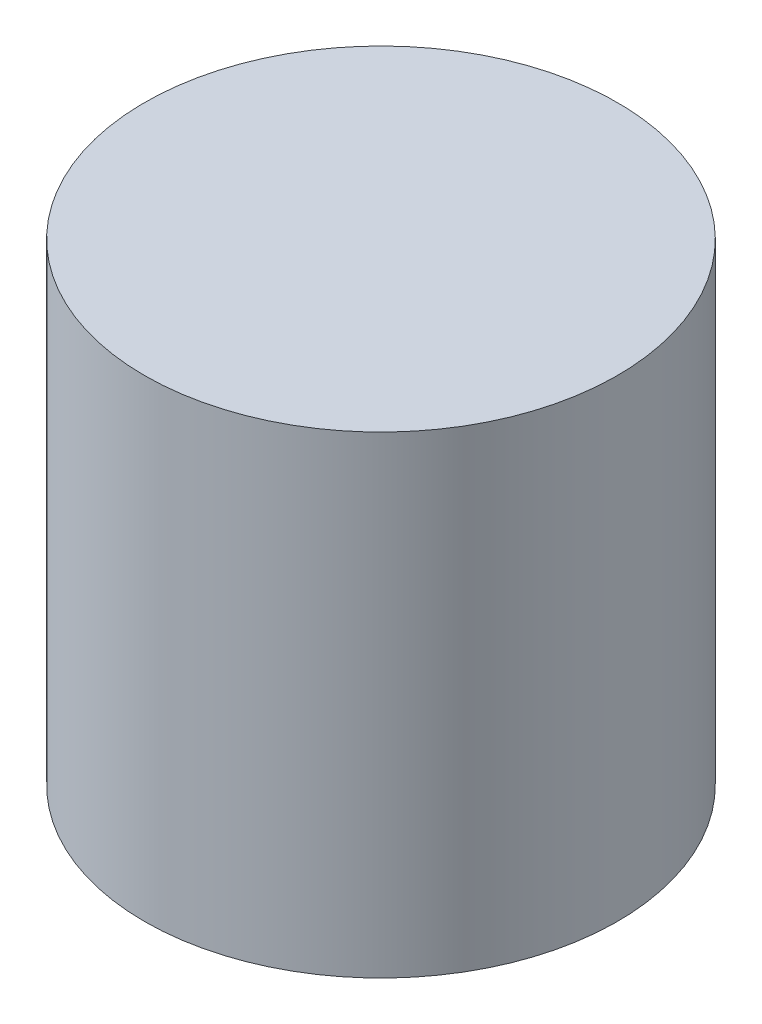
ISO-10303-21;
HEADER;
FILE_DESCRIPTION(('STEP AP214'),'2;1');
FILE_NAME('part.step','',(''),(''),'','','');
FILE_SCHEMA(('AUTOMOTIVE_DESIGN { 1 0 10303 214 1 1 1 1 }'));
ENDSEC;
DATA;
#1=APPLICATION_CONTEXT('core data for automotive mechanical design processes');
#2=APPLICATION_PROTOCOL_DEFINITION('international standard','automotive_design',2000,#1);
#3=PRODUCT_CONTEXT('',#1,'mechanical');
#4=PRODUCT('Part','Part','',(#3));
#5=PRODUCT_RELATED_PRODUCT_CATEGORY('part','',(#4));
#6=PRODUCT_DEFINITION_FORMATION('','',#4);
#7=PRODUCT_DEFINITION_CONTEXT('part definition',#1,'design');
#8=PRODUCT_DEFINITION('design','',#6,#7);
#9=PRODUCT_DEFINITION_SHAPE('','',#8);
#10=(LENGTH_UNIT() NAMED_UNIT(*) SI_UNIT(.MILLI.,.METRE.));
#11=(NAMED_UNIT(*) PLANE_ANGLE_UNIT() SI_UNIT($,.RADIAN.));
#12=(NAMED_UNIT(*) SI_UNIT($,.STERADIAN.) SOLID_ANGLE_UNIT());
#13=UNCERTAINTY_MEASURE_WITH_UNIT(LENGTH_MEASURE(1.E-05),#10,'distance_accuracy_value','');
#14=(GEOMETRIC_REPRESENTATION_CONTEXT(3) GLOBAL_UNCERTAINTY_ASSIGNED_CONTEXT((#13)) GLOBAL_UNIT_ASSIGNED_CONTEXT((#10,
#11,#12)) REPRESENTATION_CONTEXT('',''));
#15=CARTESIAN_POINT('',(0.,0.,0.));
#16=DIRECTION('',(0.,0.,1.));
#17=DIRECTION('',(1.,0.,0.));
#18=AXIS2_PLACEMENT_3D('',#15,#16,#17);
#19=CARTESIAN_POINT('',(0.,6.,0.));
#20=DIRECTION('',(0.,-1.,0.));
#21=DIRECTION('',(0.,0.,-1.));
#22=AXIS2_PLACEMENT_3D('',#19,#20,#21);
#23=CYLINDRICAL_SURFACE('',#22,3.);
#24=CARTESIAN_POINT('',(0.,6.,0.));
#25=DIRECTION('',(0.,1.,0.));
#26=DIRECTION('',(0.,0.,1.));
#27=AXIS2_PLACEMENT_3D('',#24,#25,#26);
#28=CIRCLE('',#27,3.);
#29=CARTESIAN_POINT('',(0.,6.,3.));
#30=VERTEX_POINT('',#29);
#31=EDGE_CURVE('E10',#30,#30,#28,.T.);
#32=ORIENTED_EDGE('',*,*,#31,.F.);
#33=EDGE_LOOP('',(#32));
#34=FACE_BOUND('',#33,.T.);
#35=CARTESIAN_POINT('',(0.,0.,0.));
#36=DIRECTION('',(0.,1.,0.));
#37=DIRECTION('',(0.,0.,1.));
#38=AXIS2_PLACEMENT_3D('',#35,#36,#37);
#39=CIRCLE('',#38,3.);
#40=CARTESIAN_POINT('',(0.,0.,3.));
#41=VERTEX_POINT('',#40);
#42=EDGE_CURVE('E36',#41,#41,#39,.T.);
#43=ORIENTED_EDGE('',*,*,#42,.T.);
#44=EDGE_LOOP('',(#43));
#45=FACE_BOUND('',#44,.T.);
#46=ADVANCED_FACE('F33',(#34,#45),#23,.T.);
#47=CARTESIAN_POINT('',(0.,6.,0.));
#48=DIRECTION('',(0.,1.,0.));
#49=DIRECTION('',(0.,0.,1.));
#50=AXIS2_PLACEMENT_3D('',#47,#48,#49);
#51=PLANE('',#50);
#52=ORIENTED_EDGE('',*,*,#31,.T.);
#53=EDGE_LOOP('',(#52));
#54=FACE_BOUND('',#53,.T.);
#55=ADVANCED_FACE('F48',(#54),#51,.T.);
#56=CARTESIAN_POINT('',(0.,0.,0.));
#57=DIRECTION('',(0.,1.,0.));
#58=DIRECTION('',(0.,0.,1.));
#59=AXIS2_PLACEMENT_3D('',#56,#57,#58);
#60=PLANE('',#59);
#61=ORIENTED_EDGE('',*,*,#42,.F.);
#62=EDGE_LOOP('',(#61));
#63=FACE_BOUND('',#62,.T.);
#64=ADVANCED_FACE('F46',(#63),#60,.F.);
#65=CLOSED_SHELL('',(#46,#55,#64));
#66=MANIFOLD_SOLID_BREP('B2',#65);
#67=ADVANCED_BREP_SHAPE_REPRESENTATION('',(#18,#66),#14);
#68=SHAPE_DEFINITION_REPRESENTATION(#9,#67);
ENDSEC;
END-ISO-10303-21;
